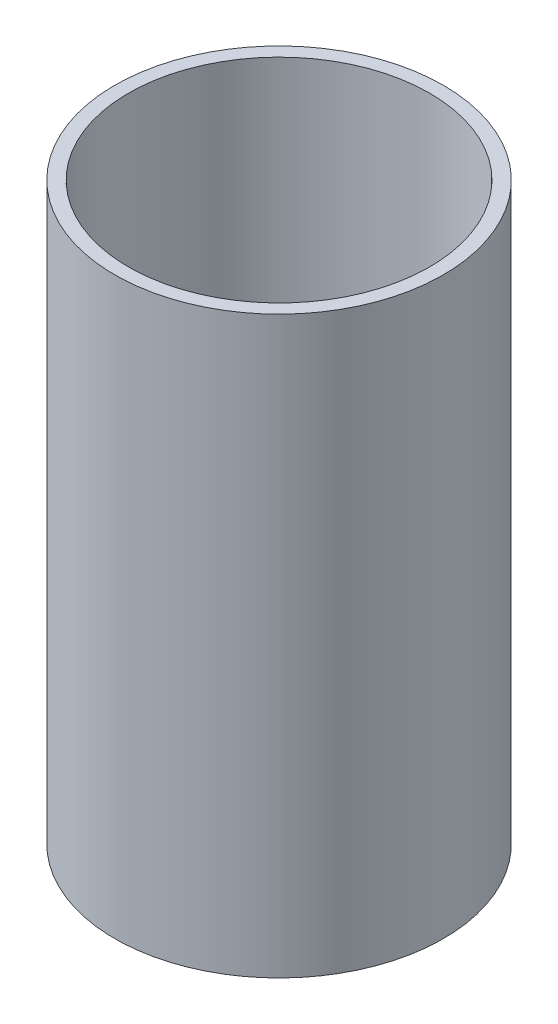
ISO-10303-21;
HEADER;
FILE_DESCRIPTION(('STEP AP214'),'2;1');
FILE_NAME('part.step','',(''),(''),'','','');
FILE_SCHEMA(('AUTOMOTIVE_DESIGN { 1 0 10303 214 1 1 1 1 }'));
ENDSEC;
DATA;
#1=APPLICATION_CONTEXT('core data for automotive mechanical design processes');
#2=APPLICATION_PROTOCOL_DEFINITION('international standard','automotive_design',2000,#1);
#3=PRODUCT_CONTEXT('',#1,'mechanical');
#4=PRODUCT('Part','Part','',(#3));
#5=PRODUCT_RELATED_PRODUCT_CATEGORY('part','',(#4));
#6=PRODUCT_DEFINITION_FORMATION('','',#4);
#7=PRODUCT_DEFINITION_CONTEXT('part definition',#1,'design');
#8=PRODUCT_DEFINITION('design','',#6,#7);
#9=PRODUCT_DEFINITION_SHAPE('','',#8);
#10=(LENGTH_UNIT() NAMED_UNIT(*) SI_UNIT(.MILLI.,.METRE.));
#11=(NAMED_UNIT(*) PLANE_ANGLE_UNIT() SI_UNIT($,.RADIAN.));
#12=(NAMED_UNIT(*) SI_UNIT($,.STERADIAN.) SOLID_ANGLE_UNIT());
#13=UNCERTAINTY_MEASURE_WITH_UNIT(LENGTH_MEASURE(1.E-05),#10,'distance_accuracy_value','');
#14=(GEOMETRIC_REPRESENTATION_CONTEXT(3) GLOBAL_UNCERTAINTY_ASSIGNED_CONTEXT((#13)) GLOBAL_UNIT_ASSIGNED_CONTEXT((#10,
#11,#12)) REPRESENTATION_CONTEXT('',''));
#15=CARTESIAN_POINT('',(0.,0.,0.));
#16=DIRECTION('',(0.,0.,1.));
#17=DIRECTION('',(1.,0.,0.));
#18=AXIS2_PLACEMENT_3D('',#15,#16,#17);
#19=CARTESIAN_POINT('',(0.,0.,0.));
#20=DIRECTION('',(0.,-1.,0.));
#21=DIRECTION('',(0.,0.,-1.));
#22=AXIS2_PLACEMENT_3D('',#19,#20,#21);
#23=CYLINDRICAL_SURFACE('',#22,11.);
#24=CARTESIAN_POINT('',(0.,0.,0.));
#25=DIRECTION('',(0.,-1.,0.));
#26=DIRECTION('',(0.,0.,-1.));
#27=AXIS2_PLACEMENT_3D('',#24,#25,#26);
#28=CIRCLE('',#27,11.);
#29=CARTESIAN_POINT('',(0.,0.,-11.));
#30=VERTEX_POINT('',#29);
#31=EDGE_CURVE('E49',#30,#30,#28,.T.);
#32=ORIENTED_EDGE('',*,*,#31,.T.);
#33=EDGE_LOOP('',(#32));
#34=FACE_BOUND('',#33,.T.);
#35=CARTESIAN_POINT('',(0.,42.,0.));
#36=DIRECTION('',(0.,-1.,0.));
#37=DIRECTION('',(0.,0.,-1.));
#38=AXIS2_PLACEMENT_3D('',#35,#36,#37);
#39=CIRCLE('',#38,11.);
#40=CARTESIAN_POINT('',(0.,42.,-11.));
#41=VERTEX_POINT('',#40);
#42=EDGE_CURVE('E10',#41,#41,#39,.T.);
#43=ORIENTED_EDGE('',*,*,#42,.F.);
#44=EDGE_LOOP('',(#43));
#45=FACE_BOUND('',#44,.T.);
#46=ADVANCED_FACE('F35',(#34,#45),#23,.F.);
#47=CARTESIAN_POINT('',(11.,42.,0.));
#48=DIRECTION('',(0.,1.,0.));
#49=DIRECTION('',(0.,0.,1.));
#50=AXIS2_PLACEMENT_3D('',#47,#48,#49);
#51=PLANE('',#50);
#52=ORIENTED_EDGE('',*,*,#42,.T.);
#53=EDGE_LOOP('',(#52));
#54=FACE_BOUND('',#53,.T.);
#55=CARTESIAN_POINT('',(0.,42.,0.));
#56=DIRECTION('',(0.,-1.,0.));
#57=DIRECTION('',(0.,0.,-1.));
#58=AXIS2_PLACEMENT_3D('',#55,#56,#57);
#59=CIRCLE('',#58,12.);
#60=CARTESIAN_POINT('',(0.,42.,-12.));
#61=VERTEX_POINT('',#60);
#62=EDGE_CURVE('E41',#61,#61,#59,.T.);
#63=ORIENTED_EDGE('',*,*,#62,.F.);
#64=EDGE_LOOP('',(#63));
#65=FACE_BOUND('',#64,.T.);
#66=ADVANCED_FACE('F65',(#54,#65),#51,.T.);
#67=CARTESIAN_POINT('',(0.,0.,0.));
#68=DIRECTION('',(0.,-1.,0.));
#69=DIRECTION('',(0.,0.,-1.));
#70=AXIS2_PLACEMENT_3D('',#67,#68,#69);
#71=CYLINDRICAL_SURFACE('',#70,12.);
#72=ORIENTED_EDGE('',*,*,#62,.T.);
#73=EDGE_LOOP('',(#72));
#74=FACE_BOUND('',#73,.T.);
#75=CARTESIAN_POINT('',(0.,0.,0.));
#76=DIRECTION('',(0.,-1.,0.));
#77=DIRECTION('',(0.,0.,-1.));
#78=AXIS2_PLACEMENT_3D('',#75,#76,#77);
#79=CIRCLE('',#78,12.);
#80=CARTESIAN_POINT('',(0.,0.,-12.));
#81=VERTEX_POINT('',#80);
#82=EDGE_CURVE('E45',#81,#81,#79,.T.);
#83=ORIENTED_EDGE('',*,*,#82,.F.);
#84=EDGE_LOOP('',(#83));
#85=FACE_BOUND('',#84,.T.);
#86=ADVANCED_FACE('F59',(#74,#85),#71,.T.);
#87=CARTESIAN_POINT('',(11.,0.,0.));
#88=DIRECTION('',(0.,-1.,0.));
#89=DIRECTION('',(0.,0.,-1.));
#90=AXIS2_PLACEMENT_3D('',#87,#88,#89);
#91=PLANE('',#90);
#92=ORIENTED_EDGE('',*,*,#82,.T.);
#93=EDGE_LOOP('',(#92));
#94=FACE_BOUND('',#93,.T.);
#95=ORIENTED_EDGE('',*,*,#31,.F.);
#96=EDGE_LOOP('',(#95));
#97=FACE_BOUND('',#96,.T.);
#98=ADVANCED_FACE('F57',(#94,#97),#91,.T.);
#99=CLOSED_SHELL('',(#46,#66,#86,#98));
#100=MANIFOLD_SOLID_BREP('B2',#99);
#101=ADVANCED_BREP_SHAPE_REPRESENTATION('',(#18,#100),#14);
#102=SHAPE_DEFINITION_REPRESENTATION(#9,#101);
ENDSEC;
END-ISO-10303-21;
